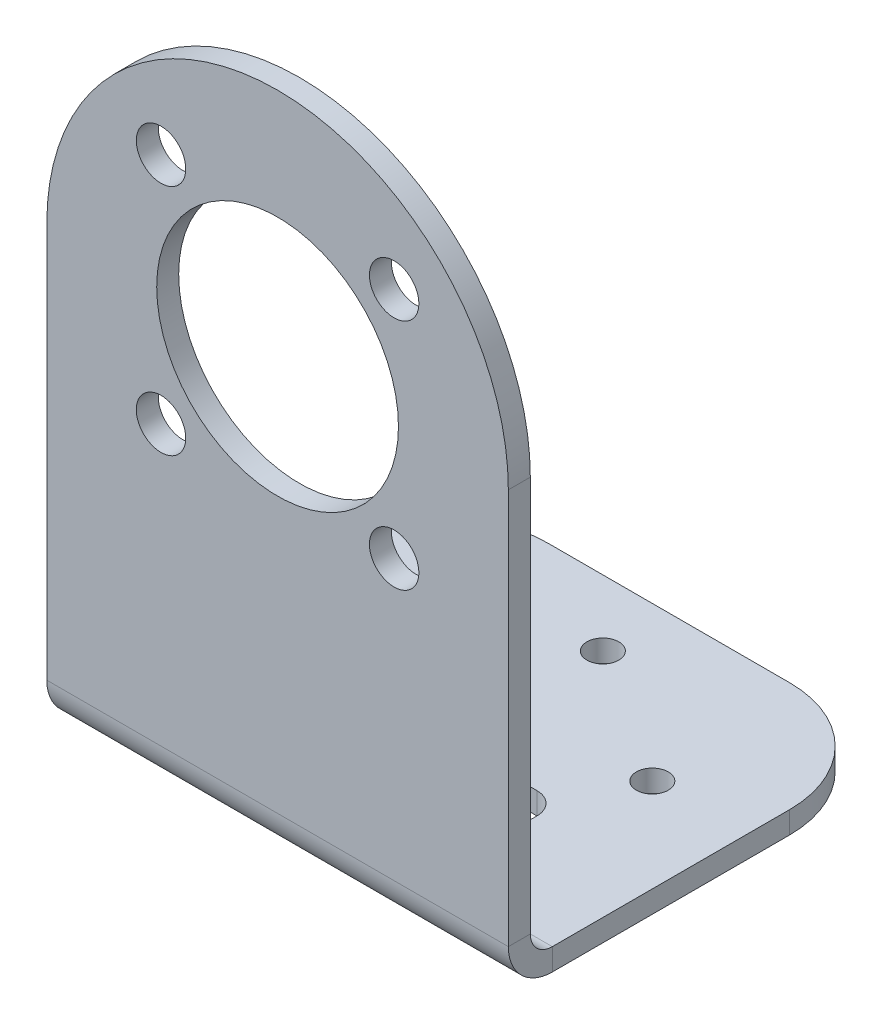
ISO-10303-21;
HEADER;
FILE_DESCRIPTION(('STEP AP214'),'2;1');
FILE_NAME('part.step','',(''),(''),'','','');
FILE_SCHEMA(('AUTOMOTIVE_DESIGN { 1 0 10303 214 1 1 1 1 }'));
ENDSEC;
DATA;
#1=APPLICATION_CONTEXT('core data for automotive mechanical design processes');
#2=APPLICATION_PROTOCOL_DEFINITION('international standard','automotive_design',2000,#1);
#3=PRODUCT_CONTEXT('',#1,'mechanical');
#4=PRODUCT('Part','Part','',(#3));
#5=PRODUCT_RELATED_PRODUCT_CATEGORY('part','',(#4));
#6=PRODUCT_DEFINITION_FORMATION('','',#4);
#7=PRODUCT_DEFINITION_CONTEXT('part definition',#1,'design');
#8=PRODUCT_DEFINITION('design','',#6,#7);
#9=PRODUCT_DEFINITION_SHAPE('','',#8);
#10=(LENGTH_UNIT() NAMED_UNIT(*) SI_UNIT(.MILLI.,.METRE.));
#11=(NAMED_UNIT(*) PLANE_ANGLE_UNIT() SI_UNIT($,.RADIAN.));
#12=(NAMED_UNIT(*) SI_UNIT($,.STERADIAN.) SOLID_ANGLE_UNIT());
#13=UNCERTAINTY_MEASURE_WITH_UNIT(LENGTH_MEASURE(1.E-05),#10,'distance_accuracy_value','');
#14=(GEOMETRIC_REPRESENTATION_CONTEXT(3) GLOBAL_UNCERTAINTY_ASSIGNED_CONTEXT((#13)) GLOBAL_UNIT_ASSIGNED_CONTEXT((#10,
#11,#12)) REPRESENTATION_CONTEXT('',''));
#15=CARTESIAN_POINT('',(0.,0.,0.));
#16=DIRECTION('',(0.,0.,1.));
#17=DIRECTION('',(1.,0.,0.));
#18=AXIS2_PLACEMENT_3D('',#15,#16,#17);
#19=CARTESIAN_POINT('',(31.,2.,26.));
#20=DIRECTION('',(-1.,0.,0.));
#21=DIRECTION('',(0.,0.,-1.));
#22=AXIS2_PLACEMENT_3D('',#19,#20,#21);
#23=PLANE('',#22);
#24=DIRECTION('',(0.,1.,0.));
#25=VECTOR('',#24,1.);
#26=CARTESIAN_POINT('',(31.,2.,22.));
#27=LINE('',#26,#25);
#28=CARTESIAN_POINT('',(31.,0.,22.));
#29=VERTEX_POINT('',#28);
#30=CARTESIAN_POINT('',(31.,2.,22.));
#31=VERTEX_POINT('',#30);
#32=EDGE_CURVE('E14',#29,#31,#27,.T.);
#33=ORIENTED_EDGE('',*,*,#32,.F.);
#34=DIRECTION('',(0.,0.,-1.));
#35=VECTOR('',#34,1.);
#36=CARTESIAN_POINT('',(31.,0.,31.6));
#37=LINE('',#36,#35);
#38=CARTESIAN_POINT('',(31.,0.,26.));
#39=VERTEX_POINT('',#38);
#40=EDGE_CURVE('E195',#39,#29,#37,.T.);
#41=ORIENTED_EDGE('',*,*,#40,.F.);
#42=DIRECTION('',(0.,1.,0.));
#43=VECTOR('',#42,1.);
#44=CARTESIAN_POINT('',(31.,2.,26.));
#45=LINE('',#44,#43);
#46=CARTESIAN_POINT('',(31.,2.,26.));
#47=VERTEX_POINT('',#46);
#48=EDGE_CURVE('E102',#39,#47,#45,.T.);
#49=ORIENTED_EDGE('',*,*,#48,.T.);
#50=DIRECTION('',(0.,0.,-1.));
#51=VECTOR('',#50,1.);
#52=CARTESIAN_POINT('',(31.,2.,26.));
#53=LINE('',#52,#51);
#54=EDGE_CURVE('E291',#47,#31,#53,.T.);
#55=ORIENTED_EDGE('',*,*,#54,.T.);
#56=EDGE_LOOP('',(#33,#41,#49,#55));
#57=FACE_BOUND('',#56,.T.);
#58=ADVANCED_FACE('F92',(#57),#23,.T.);
#59=CARTESIAN_POINT('',(29.,2.,26.));
#60=DIRECTION('',(0.,-1.,0.));
#61=DIRECTION('',(0.,0.,-1.));
#62=AXIS2_PLACEMENT_3D('',#59,#60,#61);
#63=CYLINDRICAL_SURFACE('',#62,2.);
#64=ORIENTED_EDGE('',*,*,#48,.F.);
#65=CARTESIAN_POINT('',(29.,0.,26.));
#66=DIRECTION('',(0.,-1.,0.));
#67=DIRECTION('',(0.,0.,-1.));
#68=AXIS2_PLACEMENT_3D('',#65,#66,#67);
#69=CIRCLE('',#68,2.);
#70=CARTESIAN_POINT('',(29.,0.,28.));
#71=VERTEX_POINT('',#70);
#72=EDGE_CURVE('E220',#71,#39,#69,.F.);
#73=ORIENTED_EDGE('',*,*,#72,.F.);
#74=DIRECTION('',(0.,1.,0.));
#75=VECTOR('',#74,1.);
#76=CARTESIAN_POINT('',(29.,2.,28.));
#77=LINE('',#76,#75);
#78=CARTESIAN_POINT('',(29.,2.,28.));
#79=VERTEX_POINT('',#78);
#80=EDGE_CURVE('E284',#71,#79,#77,.T.);
#81=ORIENTED_EDGE('',*,*,#80,.T.);
#82=CARTESIAN_POINT('',(29.,2.,26.));
#83=DIRECTION('',(0.,-1.,0.));
#84=DIRECTION('',(0.,0.,-1.));
#85=AXIS2_PLACEMENT_3D('',#82,#83,#84);
#86=CIRCLE('',#85,2.);
#87=EDGE_CURVE('E302',#79,#47,#86,.F.);
#88=ORIENTED_EDGE('',*,*,#87,.T.);
#89=EDGE_LOOP('',(#64,#73,#81,#88));
#90=FACE_BOUND('',#89,.T.);
#91=ADVANCED_FACE('F305',(#90),#63,.F.);
#92=CARTESIAN_POINT('',(13.,2.,28.));
#93=DIRECTION('',(0.,0.,-1.));
#94=DIRECTION('',(1.,0.,0.));
#95=AXIS2_PLACEMENT_3D('',#92,#93,#94);
#96=PLANE('',#95);
#97=ORIENTED_EDGE('',*,*,#80,.F.);
#98=DIRECTION('',(1.,0.,0.));
#99=VECTOR('',#98,1.);
#100=CARTESIAN_POINT('',(42.,0.,28.));
#101=LINE('',#100,#99);
#102=CARTESIAN_POINT('',(13.,0.,28.));
#103=VERTEX_POINT('',#102);
#104=EDGE_CURVE('E217',#103,#71,#101,.T.);
#105=ORIENTED_EDGE('',*,*,#104,.F.);
#106=DIRECTION('',(0.,1.,0.));
#107=VECTOR('',#106,1.);
#108=CARTESIAN_POINT('',(13.,2.,28.));
#109=LINE('',#108,#107);
#110=CARTESIAN_POINT('',(13.,2.,28.));
#111=VERTEX_POINT('',#110);
#112=EDGE_CURVE('E281',#103,#111,#109,.T.);
#113=ORIENTED_EDGE('',*,*,#112,.T.);
#114=DIRECTION('',(1.,0.,0.));
#115=VECTOR('',#114,1.);
#116=CARTESIAN_POINT('',(13.,2.,28.));
#117=LINE('',#116,#115);
#118=EDGE_CURVE('E306',#111,#79,#117,.T.);
#119=ORIENTED_EDGE('',*,*,#118,.T.);
#120=EDGE_LOOP('',(#97,#105,#113,#119));
#121=FACE_BOUND('',#120,.T.);
#122=ADVANCED_FACE('F478',(#121),#96,.T.);
#123=CARTESIAN_POINT('',(13.,2.,26.));
#124=DIRECTION('',(0.,-1.,0.));
#125=DIRECTION('',(0.,0.,-1.));
#126=AXIS2_PLACEMENT_3D('',#123,#124,#125);
#127=CYLINDRICAL_SURFACE('',#126,2.);
#128=ORIENTED_EDGE('',*,*,#112,.F.);
#129=CARTESIAN_POINT('',(13.,0.,26.));
#130=DIRECTION('',(0.,-1.,0.));
#131=DIRECTION('',(0.,0.,-1.));
#132=AXIS2_PLACEMENT_3D('',#129,#130,#131);
#133=CIRCLE('',#132,2.);
#134=CARTESIAN_POINT('',(11.,0.,26.));
#135=VERTEX_POINT('',#134);
#136=EDGE_CURVE('E214',#135,#103,#133,.F.);
#137=ORIENTED_EDGE('',*,*,#136,.F.);
#138=DIRECTION('',(0.,1.,0.));
#139=VECTOR('',#138,1.);
#140=CARTESIAN_POINT('',(11.,2.,26.));
#141=LINE('',#140,#139);
#142=CARTESIAN_POINT('',(11.,2.,26.));
#143=VERTEX_POINT('',#142);
#144=EDGE_CURVE('E278',#135,#143,#141,.T.);
#145=ORIENTED_EDGE('',*,*,#144,.T.);
#146=CARTESIAN_POINT('',(13.,2.,26.));
#147=DIRECTION('',(0.,-1.,0.));
#148=DIRECTION('',(0.,0.,-1.));
#149=AXIS2_PLACEMENT_3D('',#146,#147,#148);
#150=CIRCLE('',#149,2.);
#151=EDGE_CURVE('E308',#143,#111,#150,.F.);
#152=ORIENTED_EDGE('',*,*,#151,.T.);
#153=EDGE_LOOP('',(#128,#137,#145,#152));
#154=FACE_BOUND('',#153,.T.);
#155=ADVANCED_FACE('F476',(#154),#127,.F.);
#156=CARTESIAN_POINT('',(11.,2.,26.));
#157=DIRECTION('',(1.,0.,0.));
#158=DIRECTION('',(0.,0.,1.));
#159=AXIS2_PLACEMENT_3D('',#156,#157,#158);
#160=PLANE('',#159);
#161=ORIENTED_EDGE('',*,*,#144,.F.);
#162=DIRECTION('',(0.,0.,-1.));
#163=VECTOR('',#162,1.);
#164=CARTESIAN_POINT('',(11.,0.,31.6));
#165=LINE('',#164,#163);
#166=CARTESIAN_POINT('',(11.,0.,22.));
#167=VERTEX_POINT('',#166);
#168=EDGE_CURVE('E211',#167,#135,#165,.F.);
#169=ORIENTED_EDGE('',*,*,#168,.F.);
#170=DIRECTION('',(0.,1.,0.));
#171=VECTOR('',#170,1.);
#172=CARTESIAN_POINT('',(11.,2.,22.));
#173=LINE('',#172,#171);
#174=CARTESIAN_POINT('',(11.,2.,22.));
#175=VERTEX_POINT('',#174);
#176=EDGE_CURVE('E275',#167,#175,#173,.T.);
#177=ORIENTED_EDGE('',*,*,#176,.T.);
#178=DIRECTION('',(0.,0.,1.));
#179=VECTOR('',#178,1.);
#180=CARTESIAN_POINT('',(11.,2.,26.));
#181=LINE('',#180,#179);
#182=EDGE_CURVE('E314',#175,#143,#181,.T.);
#183=ORIENTED_EDGE('',*,*,#182,.T.);
#184=EDGE_LOOP('',(#161,#169,#177,#183));
#185=FACE_BOUND('',#184,.T.);
#186=ADVANCED_FACE('F479',(#185),#160,.T.);
#187=CARTESIAN_POINT('',(13.,2.,22.));
#188=DIRECTION('',(0.,-1.,0.));
#189=DIRECTION('',(0.,0.,-1.));
#190=AXIS2_PLACEMENT_3D('',#187,#188,#189);
#191=CYLINDRICAL_SURFACE('',#190,2.);
#192=ORIENTED_EDGE('',*,*,#176,.F.);
#193=CARTESIAN_POINT('',(13.,0.,22.));
#194=DIRECTION('',(0.,-1.,0.));
#195=DIRECTION('',(0.,0.,-1.));
#196=AXIS2_PLACEMENT_3D('',#193,#194,#195);
#197=CIRCLE('',#196,2.);
#198=CARTESIAN_POINT('',(13.,0.,20.));
#199=VERTEX_POINT('',#198);
#200=EDGE_CURVE('E208',#199,#167,#197,.F.);
#201=ORIENTED_EDGE('',*,*,#200,.F.);
#202=DIRECTION('',(0.,1.,0.));
#203=VECTOR('',#202,1.);
#204=CARTESIAN_POINT('',(13.,2.,20.));
#205=LINE('',#204,#203);
#206=CARTESIAN_POINT('',(13.,2.,20.));
#207=VERTEX_POINT('',#206);
#208=EDGE_CURVE('E185',#199,#207,#205,.T.);
#209=ORIENTED_EDGE('',*,*,#208,.T.);
#210=CARTESIAN_POINT('',(13.,2.,22.));
#211=DIRECTION('',(0.,-1.,0.));
#212=DIRECTION('',(0.,0.,-1.));
#213=AXIS2_PLACEMENT_3D('',#210,#211,#212);
#214=CIRCLE('',#213,2.);
#215=EDGE_CURVE('E317',#207,#175,#214,.F.);
#216=ORIENTED_EDGE('',*,*,#215,.T.);
#217=EDGE_LOOP('',(#192,#201,#209,#216));
#218=FACE_BOUND('',#217,.T.);
#219=ADVANCED_FACE('F470',(#218),#191,.F.);
#220=CARTESIAN_POINT('',(13.,2.,20.));
#221=DIRECTION('',(0.,0.,1.));
#222=DIRECTION('',(-1.,0.,0.));
#223=AXIS2_PLACEMENT_3D('',#220,#221,#222);
#224=PLANE('',#223);
#225=ORIENTED_EDGE('',*,*,#208,.F.);
#226=DIRECTION('',(1.,0.,0.));
#227=VECTOR('',#226,1.);
#228=CARTESIAN_POINT('',(42.,0.,20.));
#229=LINE('',#228,#227);
#230=CARTESIAN_POINT('',(29.,0.,20.));
#231=VERTEX_POINT('',#230);
#232=EDGE_CURVE('E192',#231,#199,#229,.F.);
#233=ORIENTED_EDGE('',*,*,#232,.F.);
#234=DIRECTION('',(0.,1.,0.));
#235=VECTOR('',#234,1.);
#236=CARTESIAN_POINT('',(29.,2.,20.));
#237=LINE('',#236,#235);
#238=CARTESIAN_POINT('',(29.,2.,20.));
#239=VERTEX_POINT('',#238);
#240=EDGE_CURVE('E96',#231,#239,#237,.T.);
#241=ORIENTED_EDGE('',*,*,#240,.T.);
#242=DIRECTION('',(-1.,0.,0.));
#243=VECTOR('',#242,1.);
#244=CARTESIAN_POINT('',(13.,2.,20.));
#245=LINE('',#244,#243);
#246=EDGE_CURVE('E462',#239,#207,#245,.T.);
#247=ORIENTED_EDGE('',*,*,#246,.T.);
#248=EDGE_LOOP('',(#225,#233,#241,#247));
#249=FACE_BOUND('',#248,.T.);
#250=ADVANCED_FACE('F197',(#249),#224,.T.);
#251=CARTESIAN_POINT('',(21.,40.,33.6));
#252=DIRECTION('',(0.,0.,1.));
#253=DIRECTION('',(1.,0.,0.));
#254=AXIS2_PLACEMENT_3D('',#251,#252,#253);
#255=CYLINDRICAL_SURFACE('',#254,21.);
#256=DIRECTION('',(0.,0.,-1.));
#257=VECTOR('',#256,1.);
#258=CARTESIAN_POINT('',(0.,40.,33.6));
#259=LINE('',#258,#257);
#260=CARTESIAN_POINT('',(0.,40.,35.6));
#261=VERTEX_POINT('',#260);
#262=CARTESIAN_POINT('',(0.,40.,33.6));
#263=VERTEX_POINT('',#262);
#264=EDGE_CURVE('E186',#261,#263,#259,.T.);
#265=ORIENTED_EDGE('',*,*,#264,.F.);
#266=CARTESIAN_POINT('',(21.,40.,35.6));
#267=DIRECTION('',(0.,0.,1.));
#268=DIRECTION('',(1.,0.,0.));
#269=AXIS2_PLACEMENT_3D('',#266,#267,#268);
#270=CIRCLE('',#269,21.);
#271=CARTESIAN_POINT('',(42.,40.,35.6));
#272=VERTEX_POINT('',#271);
#273=EDGE_CURVE('E375',#261,#272,#270,.F.);
#274=ORIENTED_EDGE('',*,*,#273,.T.);
#275=DIRECTION('',(0.,0.,-1.));
#276=VECTOR('',#275,1.);
#277=CARTESIAN_POINT('',(42.,40.,33.6));
#278=LINE('',#277,#276);
#279=CARTESIAN_POINT('',(42.,40.,33.6));
#280=VERTEX_POINT('',#279);
#281=EDGE_CURVE('E266',#272,#280,#278,.T.);
#282=ORIENTED_EDGE('',*,*,#281,.T.);
#283=CARTESIAN_POINT('',(21.,40.,33.6));
#284=DIRECTION('',(0.,0.,1.));
#285=DIRECTION('',(1.,0.,0.));
#286=AXIS2_PLACEMENT_3D('',#283,#284,#285);
#287=CIRCLE('',#286,21.);
#288=EDGE_CURVE('E449',#263,#280,#287,.F.);
#289=ORIENTED_EDGE('',*,*,#288,.F.);
#290=EDGE_LOOP('',(#265,#274,#282,#289));
#291=FACE_BOUND('',#290,.T.);
#292=ADVANCED_FACE('F448',(#291),#255,.T.);
#293=CARTESIAN_POINT('',(42.,61.,33.6));
#294=DIRECTION('',(1.,0.,0.));
#295=DIRECTION('',(0.,1.,0.));
#296=AXIS2_PLACEMENT_3D('',#293,#294,#295);
#297=PLANE('',#296);
#298=ORIENTED_EDGE('',*,*,#281,.F.);
#299=DIRECTION('',(0.,1.,0.));
#300=VECTOR('',#299,1.);
#301=CARTESIAN_POINT('',(42.,61.,35.6));
#302=LINE('',#301,#300);
#303=CARTESIAN_POINT('',(42.,4.00000000000002,35.6));
#304=VERTEX_POINT('',#303);
#305=EDGE_CURVE('E202',#304,#272,#302,.T.);
#306=ORIENTED_EDGE('',*,*,#305,.F.);
#307=DIRECTION('',(0.,0.,-1.));
#308=VECTOR('',#307,1.);
#309=CARTESIAN_POINT('',(42.,4.,33.6));
#310=LINE('',#309,#308);
#311=CARTESIAN_POINT('',(42.,4.,33.6));
#312=VERTEX_POINT('',#311);
#313=EDGE_CURVE('E263',#304,#312,#310,.T.);
#314=ORIENTED_EDGE('',*,*,#313,.T.);
#315=DIRECTION('',(0.,1.,0.));
#316=VECTOR('',#315,1.);
#317=CARTESIAN_POINT('',(42.,61.,33.6));
#318=LINE('',#317,#316);
#319=EDGE_CURVE('E456',#312,#280,#318,.T.);
#320=ORIENTED_EDGE('',*,*,#319,.T.);
#321=EDGE_LOOP('',(#298,#306,#314,#320));
#322=FACE_BOUND('',#321,.T.);
#323=ADVANCED_FACE('F459',(#322),#297,.T.);
#324=CARTESIAN_POINT('',(42.,4.,31.6));
#325=DIRECTION('',(1.,0.,0.));
#326=DIRECTION('',(0.,0.,-1.));
#327=AXIS2_PLACEMENT_3D('',#324,#325,#326);
#328=PLANE('',#327);
#329=ORIENTED_EDGE('',*,*,#313,.F.);
#330=CARTESIAN_POINT('',(42.,4.,31.6));
#331=DIRECTION('',(-1.,0.,0.));
#332=DIRECTION('',(0.,0.,1.));
#333=AXIS2_PLACEMENT_3D('',#330,#331,#332);
#334=CIRCLE('',#333,4.);
#335=CARTESIAN_POINT('',(42.,0.,31.6));
#336=VERTEX_POINT('',#335);
#337=EDGE_CURVE('E359',#336,#304,#334,.T.);
#338=ORIENTED_EDGE('',*,*,#337,.F.);
#339=DIRECTION('',(0.,1.,0.));
#340=VECTOR('',#339,1.);
#341=CARTESIAN_POINT('',(42.,2.,31.6));
#342=LINE('',#341,#340);
#343=CARTESIAN_POINT('',(42.,2.,31.6));
#344=VERTEX_POINT('',#343);
#345=EDGE_CURVE('E260',#336,#344,#342,.T.);
#346=ORIENTED_EDGE('',*,*,#345,.T.);
#347=CARTESIAN_POINT('',(42.,4.,31.6));
#348=DIRECTION('',(-1.,0.,0.));
#349=DIRECTION('',(0.,0.,-1.));
#350=AXIS2_PLACEMENT_3D('',#347,#348,#349);
#351=CIRCLE('',#350,2.);
#352=EDGE_CURVE('E273',#344,#312,#351,.T.);
#353=ORIENTED_EDGE('',*,*,#352,.T.);
#354=EDGE_LOOP('',(#329,#338,#346,#353));
#355=FACE_BOUND('',#354,.T.);
#356=ADVANCED_FACE('F426',(#355),#328,.T.);
#357=CARTESIAN_POINT('',(42.,2.,31.6));
#358=DIRECTION('',(1.,0.,0.));
#359=DIRECTION('',(0.,0.,1.));
#360=AXIS2_PLACEMENT_3D('',#357,#358,#359);
#361=PLANE('',#360);
#362=ORIENTED_EDGE('',*,*,#345,.F.);
#363=DIRECTION('',(0.,0.,-1.));
#364=VECTOR('',#363,1.);
#365=CARTESIAN_POINT('',(42.,0.,31.6));
#366=LINE('',#365,#364);
#367=CARTESIAN_POINT('',(42.,0.,10.));
#368=VERTEX_POINT('',#367);
#369=EDGE_CURVE('E354',#368,#336,#366,.F.);
#370=ORIENTED_EDGE('',*,*,#369,.F.);
#371=DIRECTION('',(0.,1.,0.));
#372=VECTOR('',#371,1.);
#373=CARTESIAN_POINT('',(42.,2.,10.));
#374=LINE('',#373,#372);
#375=CARTESIAN_POINT('',(42.,2.,10.));
#376=VERTEX_POINT('',#375);
#377=EDGE_CURVE('E258',#368,#376,#374,.T.);
#378=ORIENTED_EDGE('',*,*,#377,.T.);
#379=DIRECTION('',(0.,0.,1.));
#380=VECTOR('',#379,1.);
#381=CARTESIAN_POINT('',(42.,2.,31.6));
#382=LINE('',#381,#380);
#383=EDGE_CURVE('E341',#376,#344,#382,.T.);
#384=ORIENTED_EDGE('',*,*,#383,.T.);
#385=EDGE_LOOP('',(#362,#370,#378,#384));
#386=FACE_BOUND('',#385,.T.);
#387=ADVANCED_FACE('F423',(#386),#361,.T.);
#388=CARTESIAN_POINT('',(32.,2.,10.));
#389=DIRECTION('',(0.,-1.,0.));
#390=DIRECTION('',(0.,0.,-1.));
#391=AXIS2_PLACEMENT_3D('',#388,#389,#390);
#392=CYLINDRICAL_SURFACE('',#391,10.);
#393=ORIENTED_EDGE('',*,*,#377,.F.);
#394=CARTESIAN_POINT('',(32.,0.,10.));
#395=DIRECTION('',(0.,-1.,0.));
#396=DIRECTION('',(0.,0.,-1.));
#397=AXIS2_PLACEMENT_3D('',#394,#395,#396);
#398=CIRCLE('',#397,10.);
#399=CARTESIAN_POINT('',(32.,0.,0.));
#400=VERTEX_POINT('',#399);
#401=EDGE_CURVE('E360',#368,#400,#398,.F.);
#402=ORIENTED_EDGE('',*,*,#401,.T.);
#403=DIRECTION('',(0.,1.,0.));
#404=VECTOR('',#403,1.);
#405=CARTESIAN_POINT('',(32.,2.,0.));
#406=LINE('',#405,#404);
#407=CARTESIAN_POINT('',(32.,2.,0.));
#408=VERTEX_POINT('',#407);
#409=EDGE_CURVE('E110',#400,#408,#406,.T.);
#410=ORIENTED_EDGE('',*,*,#409,.T.);
#411=CARTESIAN_POINT('',(32.,2.,10.));
#412=DIRECTION('',(0.,-1.,0.));
#413=DIRECTION('',(0.,0.,-1.));
#414=AXIS2_PLACEMENT_3D('',#411,#412,#413);
#415=CIRCLE('',#414,10.);
#416=EDGE_CURVE('E344',#376,#408,#415,.F.);
#417=ORIENTED_EDGE('',*,*,#416,.F.);
#418=EDGE_LOOP('',(#393,#402,#410,#417));
#419=FACE_BOUND('',#418,.T.);
#420=ADVANCED_FACE('F418',(#419),#392,.T.);
#421=CARTESIAN_POINT('',(42.,2.,0.));
#422=DIRECTION('',(0.,0.,1.));
#423=DIRECTION('',(-1.,0.,0.));
#424=AXIS2_PLACEMENT_3D('',#421,#422,#423);
#425=PLANE('',#424);
#426=ORIENTED_EDGE('',*,*,#409,.F.);
#427=DIRECTION('',(1.,0.,0.));
#428=VECTOR('',#427,1.);
#429=CARTESIAN_POINT('',(42.,0.,0.));
#430=LINE('',#429,#428);
#431=CARTESIAN_POINT('',(10.,0.,0.));
#432=VERTEX_POINT('',#431);
#433=EDGE_CURVE('E231',#400,#432,#430,.F.);
#434=ORIENTED_EDGE('',*,*,#433,.T.);
#435=DIRECTION('',(0.,1.,0.));
#436=VECTOR('',#435,1.);
#437=CARTESIAN_POINT('',(10.,2.,0.));
#438=LINE('',#437,#436);
#439=CARTESIAN_POINT('',(10.,2.,0.));
#440=VERTEX_POINT('',#439);
#441=EDGE_CURVE('E254',#432,#440,#438,.T.);
#442=ORIENTED_EDGE('',*,*,#441,.T.);
#443=DIRECTION('',(-1.,0.,0.));
#444=VECTOR('',#443,1.);
#445=CARTESIAN_POINT('',(42.,2.,0.));
#446=LINE('',#445,#444);
#447=EDGE_CURVE('E329',#408,#440,#446,.T.);
#448=ORIENTED_EDGE('',*,*,#447,.F.);
#449=EDGE_LOOP('',(#426,#434,#442,#448));
#450=FACE_BOUND('',#449,.T.);
#451=ADVANCED_FACE('F412',(#450),#425,.F.);
#452=CARTESIAN_POINT('',(10.,2.,10.));
#453=DIRECTION('',(0.,-1.,0.));
#454=DIRECTION('',(0.,0.,-1.));
#455=AXIS2_PLACEMENT_3D('',#452,#453,#454);
#456=CYLINDRICAL_SURFACE('',#455,10.);
#457=ORIENTED_EDGE('',*,*,#441,.F.);
#458=CARTESIAN_POINT('',(10.,0.,10.));
#459=DIRECTION('',(0.,-1.,0.));
#460=DIRECTION('',(0.,0.,-1.));
#461=AXIS2_PLACEMENT_3D('',#458,#459,#460);
#462=CIRCLE('',#461,10.);
#463=CARTESIAN_POINT('',(0.,0.,10.));
#464=VERTEX_POINT('',#463);
#465=EDGE_CURVE('E363',#432,#464,#462,.F.);
#466=ORIENTED_EDGE('',*,*,#465,.T.);
#467=DIRECTION('',(0.,1.,0.));
#468=VECTOR('',#467,1.);
#469=CARTESIAN_POINT('',(0.,2.,10.));
#470=LINE('',#469,#468);
#471=CARTESIAN_POINT('',(0.,2.,10.));
#472=VERTEX_POINT('',#471);
#473=EDGE_CURVE('E250',#464,#472,#470,.T.);
#474=ORIENTED_EDGE('',*,*,#473,.T.);
#475=CARTESIAN_POINT('',(10.,2.,10.));
#476=DIRECTION('',(0.,-1.,0.));
#477=DIRECTION('',(0.,0.,-1.));
#478=AXIS2_PLACEMENT_3D('',#475,#476,#477);
#479=CIRCLE('',#478,10.);
#480=EDGE_CURVE('E332',#440,#472,#479,.F.);
#481=ORIENTED_EDGE('',*,*,#480,.F.);
#482=EDGE_LOOP('',(#457,#466,#474,#481));
#483=FACE_BOUND('',#482,.T.);
#484=ADVANCED_FACE('F406',(#483),#456,.T.);
#485=CARTESIAN_POINT('',(0.,2.,31.6));
#486=DIRECTION('',(1.,0.,0.));
#487=DIRECTION('',(0.,0.,1.));
#488=AXIS2_PLACEMENT_3D('',#485,#486,#487);
#489=PLANE('',#488);
#490=ORIENTED_EDGE('',*,*,#473,.F.);
#491=DIRECTION('',(0.,0.,-1.));
#492=VECTOR('',#491,1.);
#493=CARTESIAN_POINT('',(0.,0.,31.6));
#494=LINE('',#493,#492);
#495=CARTESIAN_POINT('',(0.,0.,31.6));
#496=VERTEX_POINT('',#495);
#497=EDGE_CURVE('E355',#464,#496,#494,.F.);
#498=ORIENTED_EDGE('',*,*,#497,.T.);
#499=DIRECTION('',(0.,1.,0.));
#500=VECTOR('',#499,1.);
#501=CARTESIAN_POINT('',(0.,2.,31.6));
#502=LINE('',#501,#500);
#503=CARTESIAN_POINT('',(0.,2.,31.6));
#504=VERTEX_POINT('',#503);
#505=EDGE_CURVE('E247',#496,#504,#502,.T.);
#506=ORIENTED_EDGE('',*,*,#505,.T.);
#507=DIRECTION('',(0.,0.,1.));
#508=VECTOR('',#507,1.);
#509=CARTESIAN_POINT('',(0.,2.,31.6));
#510=LINE('',#509,#508);
#511=EDGE_CURVE('E335',#472,#504,#510,.T.);
#512=ORIENTED_EDGE('',*,*,#511,.F.);
#513=EDGE_LOOP('',(#490,#498,#506,#512));
#514=FACE_BOUND('',#513,.T.);
#515=ADVANCED_FACE('F399',(#514),#489,.F.);
#516=CARTESIAN_POINT('',(0.,4.,31.6));
#517=DIRECTION('',(1.,0.,0.));
#518=DIRECTION('',(0.,0.,-1.));
#519=AXIS2_PLACEMENT_3D('',#516,#517,#518);
#520=PLANE('',#519);
#521=ORIENTED_EDGE('',*,*,#505,.F.);
#522=CARTESIAN_POINT('',(0.,4.,31.6));
#523=DIRECTION('',(-1.,0.,0.));
#524=DIRECTION('',(0.,0.,1.));
#525=AXIS2_PLACEMENT_3D('',#522,#523,#524);
#526=CIRCLE('',#525,4.);
#527=CARTESIAN_POINT('',(0.,4.,35.6));
#528=VERTEX_POINT('',#527);
#529=EDGE_CURVE('E356',#496,#528,#526,.T.);
#530=ORIENTED_EDGE('',*,*,#529,.T.);
#531=DIRECTION('',(0.,0.,-1.));
#532=VECTOR('',#531,1.);
#533=CARTESIAN_POINT('',(0.,4.,33.6));
#534=LINE('',#533,#532);
#535=CARTESIAN_POINT('',(0.,4.,33.6));
#536=VERTEX_POINT('',#535);
#537=EDGE_CURVE('E251',#528,#536,#534,.T.);
#538=ORIENTED_EDGE('',*,*,#537,.T.);
#539=CARTESIAN_POINT('',(0.,4.,31.6));
#540=DIRECTION('',(-1.,0.,0.));
#541=DIRECTION('',(0.,0.,-1.));
#542=AXIS2_PLACEMENT_3D('',#539,#540,#541);
#543=CIRCLE('',#542,2.);
#544=EDGE_CURVE('E346',#504,#536,#543,.T.);
#545=ORIENTED_EDGE('',*,*,#544,.F.);
#546=EDGE_LOOP('',(#521,#530,#538,#545));
#547=FACE_BOUND('',#546,.T.);
#548=ADVANCED_FACE('F391',(#547),#520,.F.);
#549=CARTESIAN_POINT('',(10.3933982822018,50.6066017177982,33.6));
#550=DIRECTION('',(0.,0.,1.));
#551=DIRECTION('',(1.,0.,0.));
#552=AXIS2_PLACEMENT_3D('',#549,#550,#551);
#553=CYLINDRICAL_SURFACE('',#552,2.25);
#554=CARTESIAN_POINT('',(10.3933982822018,50.6066017177982,33.6));
#555=DIRECTION('',(0.,0.,1.));
#556=DIRECTION('',(1.,0.,0.));
#557=AXIS2_PLACEMENT_3D('',#554,#555,#556);
#558=CIRCLE('',#557,2.25);
#559=CARTESIAN_POINT('',(12.6433982822018,50.6066017177982,33.6));
#560=VERTEX_POINT('',#559);
#561=EDGE_CURVE('E373',#560,#560,#558,.T.);
#562=ORIENTED_EDGE('',*,*,#561,.F.);
#563=EDGE_LOOP('',(#562));
#564=FACE_BOUND('',#563,.T.);
#565=CARTESIAN_POINT('',(10.3933982822018,50.6066017177982,35.6));
#566=DIRECTION('',(0.,0.,1.));
#567=DIRECTION('',(1.,0.,0.));
#568=AXIS2_PLACEMENT_3D('',#565,#566,#567);
#569=CIRCLE('',#568,2.25);
#570=CARTESIAN_POINT('',(12.6433982822018,50.6066017177982,35.6));
#571=VERTEX_POINT('',#570);
#572=EDGE_CURVE('E232',#571,#571,#569,.T.);
#573=ORIENTED_EDGE('',*,*,#572,.T.);
#574=EDGE_LOOP('',(#573));
#575=FACE_BOUND('',#574,.T.);
#576=ADVANCED_FACE('F510',(#564,#575),#553,.F.);
#577=CARTESIAN_POINT('',(31.6066017177982,50.6066017177982,33.6));
#578=DIRECTION('',(0.,0.,1.));
#579=DIRECTION('',(1.,0.,0.));
#580=AXIS2_PLACEMENT_3D('',#577,#578,#579);
#581=CYLINDRICAL_SURFACE('',#580,2.25);
#582=CARTESIAN_POINT('',(31.6066017177982,50.6066017177982,33.6));
#583=DIRECTION('',(0.,0.,1.));
#584=DIRECTION('',(1.,0.,0.));
#585=AXIS2_PLACEMENT_3D('',#582,#583,#584);
#586=CIRCLE('',#585,2.25);
#587=CARTESIAN_POINT('',(33.8566017177982,50.6066017177982,33.6));
#588=VERTEX_POINT('',#587);
#589=EDGE_CURVE('E862',#588,#588,#586,.T.);
#590=ORIENTED_EDGE('',*,*,#589,.F.);
#591=EDGE_LOOP('',(#590));
#592=FACE_BOUND('',#591,.T.);
#593=CARTESIAN_POINT('',(31.6066017177982,50.6066017177982,35.6));
#594=DIRECTION('',(0.,0.,1.));
#595=DIRECTION('',(1.,0.,0.));
#596=AXIS2_PLACEMENT_3D('',#593,#594,#595);
#597=CIRCLE('',#596,2.25);
#598=CARTESIAN_POINT('',(33.8566017177982,50.6066017177982,35.6));
#599=VERTEX_POINT('',#598);
#600=EDGE_CURVE('E235',#599,#599,#597,.T.);
#601=ORIENTED_EDGE('',*,*,#600,.T.);
#602=EDGE_LOOP('',(#601));
#603=FACE_BOUND('',#602,.T.);
#604=ADVANCED_FACE('F513',(#592,#603),#581,.F.);
#605=CARTESIAN_POINT('',(31.6066017177982,29.3933982822018,33.6));
#606=DIRECTION('',(0.,0.,1.));
#607=DIRECTION('',(1.,0.,0.));
#608=AXIS2_PLACEMENT_3D('',#605,#606,#607);
#609=CYLINDRICAL_SURFACE('',#608,2.25);
#610=CARTESIAN_POINT('',(31.6066017177982,29.3933982822018,33.6));
#611=DIRECTION('',(0.,0.,1.));
#612=DIRECTION('',(1.,0.,0.));
#613=AXIS2_PLACEMENT_3D('',#610,#611,#612);
#614=CIRCLE('',#613,2.25);
#615=CARTESIAN_POINT('',(33.8566017177982,29.3933982822018,33.6));
#616=VERTEX_POINT('',#615);
#617=EDGE_CURVE('E866',#616,#616,#614,.T.);
#618=ORIENTED_EDGE('',*,*,#617,.F.);
#619=EDGE_LOOP('',(#618));
#620=FACE_BOUND('',#619,.T.);
#621=CARTESIAN_POINT('',(31.6066017177982,29.3933982822018,35.6));
#622=DIRECTION('',(0.,0.,1.));
#623=DIRECTION('',(1.,0.,0.));
#624=AXIS2_PLACEMENT_3D('',#621,#622,#623);
#625=CIRCLE('',#624,2.25);
#626=CARTESIAN_POINT('',(33.8566017177982,29.3933982822018,35.6));
#627=VERTEX_POINT('',#626);
#628=EDGE_CURVE('E238',#627,#627,#625,.T.);
#629=ORIENTED_EDGE('',*,*,#628,.T.);
#630=EDGE_LOOP('',(#629));
#631=FACE_BOUND('',#630,.T.);
#632=ADVANCED_FACE('F517',(#620,#631),#609,.F.);
#633=CARTESIAN_POINT('',(10.3933982822018,29.3933982822018,33.6));
#634=DIRECTION('',(0.,0.,1.));
#635=DIRECTION('',(1.,0.,0.));
#636=AXIS2_PLACEMENT_3D('',#633,#634,#635);
#637=CYLINDRICAL_SURFACE('',#636,2.25);
#638=CARTESIAN_POINT('',(10.3933982822018,29.3933982822018,33.6));
#639=DIRECTION('',(0.,0.,1.));
#640=DIRECTION('',(1.,0.,0.));
#641=AXIS2_PLACEMENT_3D('',#638,#639,#640);
#642=CIRCLE('',#641,2.25);
#643=CARTESIAN_POINT('',(12.6433982822018,29.3933982822018,33.6));
#644=VERTEX_POINT('',#643);
#645=EDGE_CURVE('E531',#644,#644,#642,.T.);
#646=ORIENTED_EDGE('',*,*,#645,.F.);
#647=EDGE_LOOP('',(#646));
#648=FACE_BOUND('',#647,.T.);
#649=CARTESIAN_POINT('',(10.3933982822018,29.3933982822018,35.6));
#650=DIRECTION('',(0.,0.,1.));
#651=DIRECTION('',(1.,0.,0.));
#652=AXIS2_PLACEMENT_3D('',#649,#650,#651);
#653=CIRCLE('',#652,2.25);
#654=CARTESIAN_POINT('',(12.6433982822018,29.3933982822018,35.6));
#655=VERTEX_POINT('',#654);
#656=EDGE_CURVE('E241',#655,#655,#653,.T.);
#657=ORIENTED_EDGE('',*,*,#656,.T.);
#658=EDGE_LOOP('',(#657));
#659=FACE_BOUND('',#658,.T.);
#660=ADVANCED_FACE('F520',(#648,#659),#637,.F.);
#661=CARTESIAN_POINT('',(21.,40.,33.6));
#662=DIRECTION('',(0.,0.,1.));
#663=DIRECTION('',(1.,0.,0.));
#664=AXIS2_PLACEMENT_3D('',#661,#662,#663);
#665=CYLINDRICAL_SURFACE('',#664,11.);
#666=CARTESIAN_POINT('',(21.,40.,33.6));
#667=DIRECTION('',(0.,0.,1.));
#668=DIRECTION('',(1.,0.,0.));
#669=AXIS2_PLACEMENT_3D('',#666,#667,#668);
#670=CIRCLE('',#669,11.);
#671=CARTESIAN_POINT('',(32.,40.,33.6));
#672=VERTEX_POINT('',#671);
#673=EDGE_CURVE('E870',#672,#672,#670,.F.);
#674=ORIENTED_EDGE('',*,*,#673,.T.);
#675=EDGE_LOOP('',(#674));
#676=FACE_BOUND('',#675,.T.);
#677=CARTESIAN_POINT('',(21.,40.,35.6));
#678=DIRECTION('',(0.,0.,1.));
#679=DIRECTION('',(1.,0.,0.));
#680=AXIS2_PLACEMENT_3D('',#677,#678,#679);
#681=CIRCLE('',#680,11.);
#682=CARTESIAN_POINT('',(32.,40.,35.6));
#683=VERTEX_POINT('',#682);
#684=EDGE_CURVE('E244',#683,#683,#681,.F.);
#685=ORIENTED_EDGE('',*,*,#684,.F.);
#686=EDGE_LOOP('',(#685));
#687=FACE_BOUND('',#686,.T.);
#688=ADVANCED_FACE('F94',(#676,#687),#665,.F.);
#689=CARTESIAN_POINT('',(29.,2.,22.));
#690=DIRECTION('',(0.,-1.,0.));
#691=DIRECTION('',(0.,0.,-1.));
#692=AXIS2_PLACEMENT_3D('',#689,#690,#691);
#693=CYLINDRICAL_SURFACE('',#692,2.);
#694=CARTESIAN_POINT('',(29.,0.,22.));
#695=DIRECTION('',(0.,-1.,0.));
#696=DIRECTION('',(0.,0.,-1.));
#697=AXIS2_PLACEMENT_3D('',#694,#695,#696);
#698=CIRCLE('',#697,2.);
#699=EDGE_CURVE('E177',#29,#231,#698,.F.);
#700=ORIENTED_EDGE('',*,*,#699,.F.);
#701=ORIENTED_EDGE('',*,*,#32,.T.);
#702=CARTESIAN_POINT('',(29.,2.,22.));
#703=DIRECTION('',(0.,-1.,0.));
#704=DIRECTION('',(0.,0.,-1.));
#705=AXIS2_PLACEMENT_3D('',#702,#703,#704);
#706=CIRCLE('',#705,2.);
#707=EDGE_CURVE('E180',#31,#239,#706,.F.);
#708=ORIENTED_EDGE('',*,*,#707,.T.);
#709=ORIENTED_EDGE('',*,*,#240,.F.);
#710=EDGE_LOOP('',(#700,#701,#708,#709));
#711=FACE_BOUND('',#710,.T.);
#712=ADVANCED_FACE('F176',(#711),#693,.F.);
#713=CARTESIAN_POINT('',(33.5,2.,14.));
#714=DIRECTION('',(0.,-1.,0.));
#715=DIRECTION('',(0.,0.,-1.));
#716=AXIS2_PLACEMENT_3D('',#713,#714,#715);
#717=CYLINDRICAL_SURFACE('',#716,1.45);
#718=CARTESIAN_POINT('',(33.5,2.,14.));
#719=DIRECTION('',(0.,1.,0.));
#720=DIRECTION('',(0.,0.,1.));
#721=AXIS2_PLACEMENT_3D('',#718,#719,#720);
#722=CIRCLE('',#721,1.45);
#723=CARTESIAN_POINT('',(33.5,2.,15.45));
#724=VERTEX_POINT('',#723);
#725=EDGE_CURVE('E320',#724,#724,#722,.T.);
#726=ORIENTED_EDGE('',*,*,#725,.T.);
#727=EDGE_LOOP('',(#726));
#728=FACE_BOUND('',#727,.T.);
#729=CARTESIAN_POINT('',(33.5,0.,14.));
#730=DIRECTION('',(0.,1.,0.));
#731=DIRECTION('',(0.,0.,1.));
#732=AXIS2_PLACEMENT_3D('',#729,#730,#731);
#733=CIRCLE('',#732,1.45);
#734=CARTESIAN_POINT('',(33.5,0.,15.45));
#735=VERTEX_POINT('',#734);
#736=EDGE_CURVE('E210',#735,#735,#733,.T.);
#737=ORIENTED_EDGE('',*,*,#736,.F.);
#738=EDGE_LOOP('',(#737));
#739=FACE_BOUND('',#738,.T.);
#740=ADVANCED_FACE('F498',(#728,#739),#717,.F.);
#741=CARTESIAN_POINT('',(8.5,2.,14.));
#742=DIRECTION('',(0.,-1.,0.));
#743=DIRECTION('',(0.,0.,-1.));
#744=AXIS2_PLACEMENT_3D('',#741,#742,#743);
#745=CYLINDRICAL_SURFACE('',#744,1.45);
#746=CARTESIAN_POINT('',(8.5,2.,14.));
#747=DIRECTION('',(0.,1.,0.));
#748=DIRECTION('',(0.,0.,1.));
#749=AXIS2_PLACEMENT_3D('',#746,#747,#748);
#750=CIRCLE('',#749,1.45);
#751=CARTESIAN_POINT('',(8.5,2.,15.45));
#752=VERTEX_POINT('',#751);
#753=EDGE_CURVE('E323',#752,#752,#750,.T.);
#754=ORIENTED_EDGE('',*,*,#753,.T.);
#755=EDGE_LOOP('',(#754));
#756=FACE_BOUND('',#755,.T.);
#757=CARTESIAN_POINT('',(8.5,0.,14.));
#758=DIRECTION('',(0.,1.,0.));
#759=DIRECTION('',(0.,0.,1.));
#760=AXIS2_PLACEMENT_3D('',#757,#758,#759);
#761=CIRCLE('',#760,1.45);
#762=CARTESIAN_POINT('',(8.5,0.,15.45));
#763=VERTEX_POINT('',#762);
#764=EDGE_CURVE('E225',#763,#763,#761,.T.);
#765=ORIENTED_EDGE('',*,*,#764,.F.);
#766=EDGE_LOOP('',(#765));
#767=FACE_BOUND('',#766,.T.);
#768=ADVANCED_FACE('F501',(#756,#767),#745,.F.);
#769=CARTESIAN_POINT('',(21.,2.,6.00000000000001));
#770=DIRECTION('',(0.,-1.,0.));
#771=DIRECTION('',(0.,0.,-1.));
#772=AXIS2_PLACEMENT_3D('',#769,#770,#771);
#773=CYLINDRICAL_SURFACE('',#772,1.45);
#774=CARTESIAN_POINT('',(21.,2.,6.00000000000001));
#775=DIRECTION('',(0.,1.,0.));
#776=DIRECTION('',(0.,0.,1.));
#777=AXIS2_PLACEMENT_3D('',#774,#775,#776);
#778=CIRCLE('',#777,1.45);
#779=CARTESIAN_POINT('',(21.,2.,7.45000000000001));
#780=VERTEX_POINT('',#779);
#781=EDGE_CURVE('E326',#780,#780,#778,.T.);
#782=ORIENTED_EDGE('',*,*,#781,.T.);
#783=EDGE_LOOP('',(#782));
#784=FACE_BOUND('',#783,.T.);
#785=CARTESIAN_POINT('',(21.,0.,6.00000000000001));
#786=DIRECTION('',(0.,1.,0.));
#787=DIRECTION('',(0.,0.,1.));
#788=AXIS2_PLACEMENT_3D('',#785,#786,#787);
#789=CIRCLE('',#788,1.45);
#790=CARTESIAN_POINT('',(21.,0.,7.45000000000001));
#791=VERTEX_POINT('',#790);
#792=EDGE_CURVE('E228',#791,#791,#789,.T.);
#793=ORIENTED_EDGE('',*,*,#792,.F.);
#794=EDGE_LOOP('',(#793));
#795=FACE_BOUND('',#794,.T.);
#796=ADVANCED_FACE('F505',(#784,#795),#773,.F.);
#797=CARTESIAN_POINT('',(0.,61.,33.6));
#798=DIRECTION('',(1.,0.,0.));
#799=DIRECTION('',(0.,1.,0.));
#800=AXIS2_PLACEMENT_3D('',#797,#798,#799);
#801=PLANE('',#800);
#802=DIRECTION('',(0.,1.,0.));
#803=VECTOR('',#802,1.);
#804=CARTESIAN_POINT('',(0.,61.,35.6));
#805=LINE('',#804,#803);
#806=EDGE_CURVE('E206',#528,#261,#805,.T.);
#807=ORIENTED_EDGE('',*,*,#806,.T.);
#808=ORIENTED_EDGE('',*,*,#264,.T.);
#809=DIRECTION('',(0.,1.,0.));
#810=VECTOR('',#809,1.);
#811=CARTESIAN_POINT('',(0.,61.,33.6));
#812=LINE('',#811,#810);
#813=EDGE_CURVE('E457',#536,#263,#812,.T.);
#814=ORIENTED_EDGE('',*,*,#813,.F.);
#815=ORIENTED_EDGE('',*,*,#537,.F.);
#816=EDGE_LOOP('',(#807,#808,#814,#815));
#817=FACE_BOUND('',#816,.T.);
#818=ADVANCED_FACE('F382',(#817),#801,.F.);
#819=CARTESIAN_POINT('',(42.,4.,31.6));
#820=DIRECTION('',(-1.,0.,0.));
#821=DIRECTION('',(0.,0.,1.));
#822=AXIS2_PLACEMENT_3D('',#819,#820,#821);
#823=CYLINDRICAL_SURFACE('',#822,2.);
#824=ORIENTED_EDGE('',*,*,#544,.T.);
#825=DIRECTION('',(-1.,0.,0.));
#826=VECTOR('',#825,1.);
#827=CARTESIAN_POINT('',(42.,4.,33.6));
#828=LINE('',#827,#826);
#829=EDGE_CURVE('E460',#312,#536,#828,.T.);
#830=ORIENTED_EDGE('',*,*,#829,.F.);
#831=ORIENTED_EDGE('',*,*,#352,.F.);
#832=DIRECTION('',(-1.,0.,0.));
#833=VECTOR('',#832,1.);
#834=CARTESIAN_POINT('',(42.,2.,31.6));
#835=LINE('',#834,#833);
#836=EDGE_CURVE('E338',#344,#504,#835,.T.);
#837=ORIENTED_EDGE('',*,*,#836,.T.);
#838=EDGE_LOOP('',(#824,#830,#831,#837));
#839=FACE_BOUND('',#838,.T.);
#840=ADVANCED_FACE('F568',(#839),#823,.F.);
#841=CARTESIAN_POINT('',(42.,2.,31.6));
#842=DIRECTION('',(0.,-1.,0.));
#843=DIRECTION('',(0.,0.,-1.));
#844=AXIS2_PLACEMENT_3D('',#841,#842,#843);
#845=PLANE('',#844);
#846=ORIENTED_EDGE('',*,*,#246,.F.);
#847=ORIENTED_EDGE('',*,*,#707,.F.);
#848=ORIENTED_EDGE('',*,*,#54,.F.);
#849=ORIENTED_EDGE('',*,*,#87,.F.);
#850=ORIENTED_EDGE('',*,*,#118,.F.);
#851=ORIENTED_EDGE('',*,*,#151,.F.);
#852=ORIENTED_EDGE('',*,*,#182,.F.);
#853=ORIENTED_EDGE('',*,*,#215,.F.);
#854=EDGE_LOOP('',(#846,#847,#848,#849,#850,#851,#852,#853));
#855=FACE_BOUND('',#854,.T.);
#856=ORIENTED_EDGE('',*,*,#725,.F.);
#857=EDGE_LOOP('',(#856));
#858=FACE_BOUND('',#857,.T.);
#859=ORIENTED_EDGE('',*,*,#753,.F.);
#860=EDGE_LOOP('',(#859));
#861=FACE_BOUND('',#860,.T.);
#862=ORIENTED_EDGE('',*,*,#781,.F.);
#863=EDGE_LOOP('',(#862));
#864=FACE_BOUND('',#863,.T.);
#865=ORIENTED_EDGE('',*,*,#447,.T.);
#866=ORIENTED_EDGE('',*,*,#480,.T.);
#867=ORIENTED_EDGE('',*,*,#511,.T.);
#868=ORIENTED_EDGE('',*,*,#836,.F.);
#869=ORIENTED_EDGE('',*,*,#383,.F.);
#870=ORIENTED_EDGE('',*,*,#416,.T.);
#871=EDGE_LOOP('',(#865,#866,#867,#868,#869,#870));
#872=FACE_BOUND('',#871,.T.);
#873=ADVANCED_FACE('F299',(#855,#858,#861,#864,#872),#845,.F.);
#874=CARTESIAN_POINT('',(42.,61.,33.6));
#875=DIRECTION('',(0.,0.,1.));
#876=DIRECTION('',(1.,0.,0.));
#877=AXIS2_PLACEMENT_3D('',#874,#875,#876);
#878=PLANE('',#877);
#879=ORIENTED_EDGE('',*,*,#561,.T.);
#880=EDGE_LOOP('',(#879));
#881=FACE_BOUND('',#880,.T.);
#882=ORIENTED_EDGE('',*,*,#589,.T.);
#883=EDGE_LOOP('',(#882));
#884=FACE_BOUND('',#883,.T.);
#885=ORIENTED_EDGE('',*,*,#617,.T.);
#886=EDGE_LOOP('',(#885));
#887=FACE_BOUND('',#886,.T.);
#888=ORIENTED_EDGE('',*,*,#645,.T.);
#889=EDGE_LOOP('',(#888));
#890=FACE_BOUND('',#889,.T.);
#891=ORIENTED_EDGE('',*,*,#673,.F.);
#892=EDGE_LOOP('',(#891));
#893=FACE_BOUND('',#892,.T.);
#894=ORIENTED_EDGE('',*,*,#813,.T.);
#895=ORIENTED_EDGE('',*,*,#288,.T.);
#896=ORIENTED_EDGE('',*,*,#319,.F.);
#897=ORIENTED_EDGE('',*,*,#829,.T.);
#898=EDGE_LOOP('',(#894,#895,#896,#897));
#899=FACE_BOUND('',#898,.T.);
#900=ADVANCED_FACE('F454',(#881,#884,#887,#890,#893,#899),#878,.F.);
#901=CARTESIAN_POINT('',(42.,4.,31.6));
#902=DIRECTION('',(-1.,0.,0.));
#903=DIRECTION('',(0.,0.,1.));
#904=AXIS2_PLACEMENT_3D('',#901,#902,#903);
#905=CYLINDRICAL_SURFACE('',#904,4.);
#906=ORIENTED_EDGE('',*,*,#529,.F.);
#907=DIRECTION('',(-1.,0.,0.));
#908=VECTOR('',#907,1.);
#909=CARTESIAN_POINT('',(42.,0.,31.6));
#910=LINE('',#909,#908);
#911=EDGE_CURVE('E351',#336,#496,#910,.T.);
#912=ORIENTED_EDGE('',*,*,#911,.F.);
#913=ORIENTED_EDGE('',*,*,#337,.T.);
#914=DIRECTION('',(1.,0.,0.));
#915=VECTOR('',#914,1.);
#916=CARTESIAN_POINT('',(42.,4.00000000000002,35.6));
#917=LINE('',#916,#915);
#918=EDGE_CURVE('E199',#304,#528,#917,.F.);
#919=ORIENTED_EDGE('',*,*,#918,.T.);
#920=EDGE_LOOP('',(#906,#912,#913,#919));
#921=FACE_BOUND('',#920,.T.);
#922=ADVANCED_FACE('F396',(#921),#905,.T.);
#923=CARTESIAN_POINT('',(42.,0.,31.6));
#924=DIRECTION('',(0.,-1.,0.));
#925=DIRECTION('',(0.,0.,-1.));
#926=AXIS2_PLACEMENT_3D('',#923,#924,#925);
#927=PLANE('',#926);
#928=ORIENTED_EDGE('',*,*,#232,.T.);
#929=ORIENTED_EDGE('',*,*,#200,.T.);
#930=ORIENTED_EDGE('',*,*,#168,.T.);
#931=ORIENTED_EDGE('',*,*,#136,.T.);
#932=ORIENTED_EDGE('',*,*,#104,.T.);
#933=ORIENTED_EDGE('',*,*,#72,.T.);
#934=ORIENTED_EDGE('',*,*,#40,.T.);
#935=ORIENTED_EDGE('',*,*,#699,.T.);
#936=EDGE_LOOP('',(#928,#929,#930,#931,#932,#933,#934,#935));
#937=FACE_BOUND('',#936,.T.);
#938=ORIENTED_EDGE('',*,*,#736,.T.);
#939=EDGE_LOOP('',(#938));
#940=FACE_BOUND('',#939,.T.);
#941=ORIENTED_EDGE('',*,*,#764,.T.);
#942=EDGE_LOOP('',(#941));
#943=FACE_BOUND('',#942,.T.);
#944=ORIENTED_EDGE('',*,*,#792,.T.);
#945=EDGE_LOOP('',(#944));
#946=FACE_BOUND('',#945,.T.);
#947=ORIENTED_EDGE('',*,*,#433,.F.);
#948=ORIENTED_EDGE('',*,*,#401,.F.);
#949=ORIENTED_EDGE('',*,*,#369,.T.);
#950=ORIENTED_EDGE('',*,*,#911,.T.);
#951=ORIENTED_EDGE('',*,*,#497,.F.);
#952=ORIENTED_EDGE('',*,*,#465,.F.);
#953=EDGE_LOOP('',(#947,#948,#949,#950,#951,#952));
#954=FACE_BOUND('',#953,.T.);
#955=ADVANCED_FACE('F189',(#937,#940,#943,#946,#954),#927,.T.);
#956=CARTESIAN_POINT('',(42.,61.,35.6));
#957=DIRECTION('',(0.,0.,1.));
#958=DIRECTION('',(1.,0.,0.));
#959=AXIS2_PLACEMENT_3D('',#956,#957,#958);
#960=PLANE('',#959);
#961=ORIENTED_EDGE('',*,*,#572,.F.);
#962=EDGE_LOOP('',(#961));
#963=FACE_BOUND('',#962,.T.);
#964=ORIENTED_EDGE('',*,*,#600,.F.);
#965=EDGE_LOOP('',(#964));
#966=FACE_BOUND('',#965,.T.);
#967=ORIENTED_EDGE('',*,*,#628,.F.);
#968=EDGE_LOOP('',(#967));
#969=FACE_BOUND('',#968,.T.);
#970=ORIENTED_EDGE('',*,*,#656,.F.);
#971=EDGE_LOOP('',(#970));
#972=FACE_BOUND('',#971,.T.);
#973=ORIENTED_EDGE('',*,*,#684,.T.);
#974=EDGE_LOOP('',(#973));
#975=FACE_BOUND('',#974,.T.);
#976=ORIENTED_EDGE('',*,*,#806,.F.);
#977=ORIENTED_EDGE('',*,*,#918,.F.);
#978=ORIENTED_EDGE('',*,*,#305,.T.);
#979=ORIENTED_EDGE('',*,*,#273,.F.);
#980=EDGE_LOOP('',(#976,#977,#978,#979));
#981=FACE_BOUND('',#980,.T.);
#982=ADVANCED_FACE('F387',(#963,#966,#969,#972,#975,#981),#960,.T.);
#983=CLOSED_SHELL('',(#58,#91,#122,#155,#186,#219,#250,#292,#323,#356,#387,#420,#451,#484,#515,
#548,#576,#604,#632,#660,#688,#712,#740,#768,#796,#818,#840,#873,#900,#922,#955,#982));
#984=MANIFOLD_SOLID_BREP('B2',#983);
#985=ADVANCED_BREP_SHAPE_REPRESENTATION('',(#18,#984),#14);
#986=SHAPE_DEFINITION_REPRESENTATION(#9,#985);
ENDSEC;
END-ISO-10303-21;
